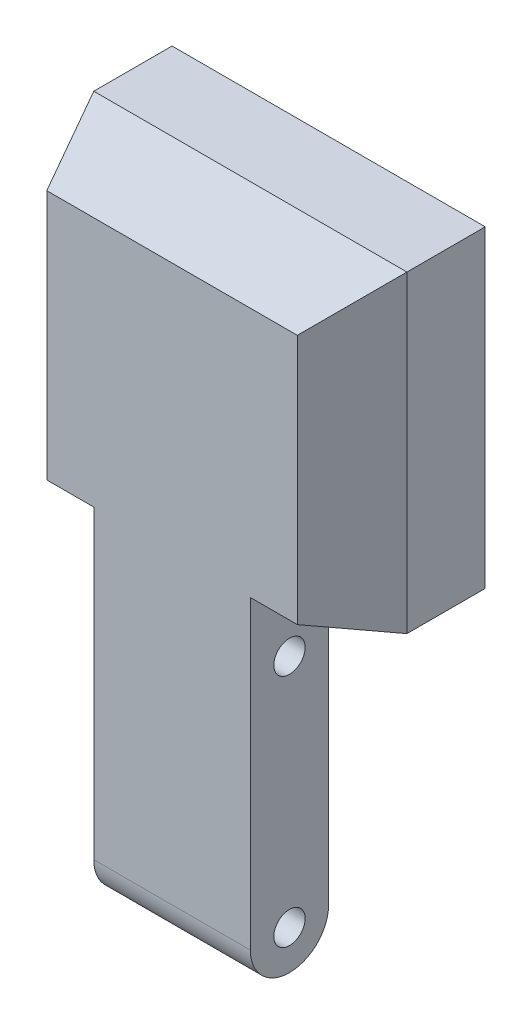
ISO-10303-21;
HEADER;
FILE_DESCRIPTION(('STEP AP214'),'2;1');
FILE_NAME('part.step','',(''),(''),'','','');
FILE_SCHEMA(('AUTOMOTIVE_DESIGN { 1 0 10303 214 1 1 1 1 }'));
ENDSEC;
DATA;
#1=APPLICATION_CONTEXT('core data for automotive mechanical design processes');
#2=APPLICATION_PROTOCOL_DEFINITION('international standard','automotive_design',2000,#1);
#3=PRODUCT_CONTEXT('',#1,'mechanical');
#4=PRODUCT('Part','Part','',(#3));
#5=PRODUCT_RELATED_PRODUCT_CATEGORY('part','',(#4));
#6=PRODUCT_DEFINITION_FORMATION('','',#4);
#7=PRODUCT_DEFINITION_CONTEXT('part definition',#1,'design');
#8=PRODUCT_DEFINITION('design','',#6,#7);
#9=PRODUCT_DEFINITION_SHAPE('','',#8);
#10=(LENGTH_UNIT() NAMED_UNIT(*) SI_UNIT(.MILLI.,.METRE.));
#11=(NAMED_UNIT(*) PLANE_ANGLE_UNIT() SI_UNIT($,.RADIAN.));
#12=(NAMED_UNIT(*) SI_UNIT($,.STERADIAN.) SOLID_ANGLE_UNIT());
#13=UNCERTAINTY_MEASURE_WITH_UNIT(LENGTH_MEASURE(1.E-05),#10,'distance_accuracy_value','');
#14=(GEOMETRIC_REPRESENTATION_CONTEXT(3) GLOBAL_UNCERTAINTY_ASSIGNED_CONTEXT((#13)) GLOBAL_UNIT_ASSIGNED_CONTEXT((#10,
#11,#12)) REPRESENTATION_CONTEXT('',''));
#15=CARTESIAN_POINT('',(0.,0.,0.));
#16=DIRECTION('',(0.,0.,1.));
#17=DIRECTION('',(1.,0.,0.));
#18=AXIS2_PLACEMENT_3D('',#15,#16,#17);
#19=CARTESIAN_POINT('',(-9.99999999999999,-4.44089209850063E-13,9.99999999999999));
#20=DIRECTION('',(-0.999999999999999,0.,0.));
#21=DIRECTION('',(0.,0.,1.));
#22=AXIS2_PLACEMENT_3D('',#19,#20,#21);
#23=PLANE('',#22);
#24=CARTESIAN_POINT('',(-9.99999999999998,-15.0000000000005,5.));
#25=DIRECTION('',(-0.999999999999999,0.,0.));
#26=DIRECTION('',(0.,0.,1.));
#27=AXIS2_PLACEMENT_3D('',#24,#25,#26);
#28=CIRCLE('',#27,2.);
#29=CARTESIAN_POINT('',(-9.99999999999998,-15.0000000000005,7.00000000000001));
#30=VERTEX_POINT('',#29);
#31=EDGE_CURVE('E163',#30,#30,#28,.T.);
#32=ORIENTED_EDGE('',*,*,#31,.F.);
#33=EDGE_LOOP('',(#32));
#34=FACE_BOUND('',#33,.T.);
#35=CARTESIAN_POINT('',(-9.99999999999997,14.9999999999996,4.99999999999995));
#36=DIRECTION('',(-0.999999999999999,0.,0.));
#37=DIRECTION('',(0.,0.,1.));
#38=AXIS2_PLACEMENT_3D('',#35,#36,#37);
#39=CIRCLE('',#38,2.);
#40=CARTESIAN_POINT('',(-9.99999999999997,14.9999999999996,6.99999999999995));
#41=VERTEX_POINT('',#40);
#42=EDGE_CURVE('E227',#41,#41,#39,.T.);
#43=ORIENTED_EDGE('',*,*,#42,.F.);
#44=EDGE_LOOP('',(#43));
#45=FACE_BOUND('',#44,.T.);
#46=CARTESIAN_POINT('',(-9.99999999999998,-15.0000000000005,5.));
#47=DIRECTION('',(-0.999999999999999,0.,0.));
#48=DIRECTION('',(0.,0.,1.));
#49=AXIS2_PLACEMENT_3D('',#46,#47,#48);
#50=CIRCLE('',#49,5.);
#51=CARTESIAN_POINT('',(-9.99999999999998,-15.,0.));
#52=VERTEX_POINT('',#51);
#53=CARTESIAN_POINT('',(-9.99999999999999,-15.0000000000005,9.99999999999999));
#54=VERTEX_POINT('',#53);
#55=EDGE_CURVE('E75',#52,#54,#50,.T.);
#56=ORIENTED_EDGE('',*,*,#55,.T.);
#57=DIRECTION('',(0.,1.,0.));
#58=VECTOR('',#57,1.);
#59=CARTESIAN_POINT('',(-9.99999999999999,-4.44089209850063E-13,9.99999999999999));
#60=LINE('',#59,#58);
#61=CARTESIAN_POINT('',(-9.99999999999998,23.9999999999996,9.99999999999995));
#62=VERTEX_POINT('',#61);
#63=EDGE_CURVE('E148',#54,#62,#60,.T.);
#64=ORIENTED_EDGE('',*,*,#63,.T.);
#65=DIRECTION('',(0.,-0.371390676354103,-0.928476690885261));
#66=VECTOR('',#65,1.);
#67=CARTESIAN_POINT('',(-9.99999999999998,20.,0.));
#68=LINE('',#67,#66);
#69=CARTESIAN_POINT('',(-9.99999999999998,20.,0.));
#70=VERTEX_POINT('',#69);
#71=EDGE_CURVE('E188',#62,#70,#68,.T.);
#72=ORIENTED_EDGE('',*,*,#71,.T.);
#73=DIRECTION('',(0.,1.,0.));
#74=VECTOR('',#73,1.);
#75=CARTESIAN_POINT('',(-9.99999999999999,0.,0.));
#76=LINE('',#75,#74);
#77=EDGE_CURVE('E161',#52,#70,#76,.T.);
#78=ORIENTED_EDGE('',*,*,#77,.F.);
#79=EDGE_LOOP('',(#56,#64,#72,#78));
#80=FACE_BOUND('',#79,.T.);
#81=ADVANCED_FACE('F60',(#34,#45,#80),#23,.T.);
#82=CARTESIAN_POINT('',(10.,0.,9.99999999999999));
#83=DIRECTION('',(-0.999999999999999,0.,0.));
#84=DIRECTION('',(0.,0.,1.));
#85=AXIS2_PLACEMENT_3D('',#82,#83,#84);
#86=PLANE('',#85);
#87=CARTESIAN_POINT('',(10.,-15.,4.99999999999999));
#88=DIRECTION('',(0.999999999999999,0.,0.));
#89=DIRECTION('',(0.,0.,-1.));
#90=AXIS2_PLACEMENT_3D('',#87,#88,#89);
#91=CIRCLE('',#90,2.);
#92=CARTESIAN_POINT('',(10.,-15.,2.99999999999999));
#93=VERTEX_POINT('',#92);
#94=EDGE_CURVE('E224',#93,#93,#91,.T.);
#95=ORIENTED_EDGE('',*,*,#94,.F.);
#96=EDGE_LOOP('',(#95));
#97=FACE_BOUND('',#96,.T.);
#98=CARTESIAN_POINT('',(9.99999999999999,15.,4.99999999999995));
#99=DIRECTION('',(0.999999999999999,0.,0.));
#100=DIRECTION('',(0.,0.,-1.));
#101=AXIS2_PLACEMENT_3D('',#98,#99,#100);
#102=CIRCLE('',#101,2.);
#103=CARTESIAN_POINT('',(9.99999999999999,15.,2.99999999999994));
#104=VERTEX_POINT('',#103);
#105=EDGE_CURVE('E223',#104,#104,#102,.T.);
#106=ORIENTED_EDGE('',*,*,#105,.F.);
#107=EDGE_LOOP('',(#106));
#108=FACE_BOUND('',#107,.T.);
#109=DIRECTION('',(0.,1.,0.));
#110=VECTOR('',#109,1.);
#111=CARTESIAN_POINT('',(10.,0.,9.99999999999999));
#112=LINE('',#111,#110);
#113=CARTESIAN_POINT('',(10.,-15.,9.99999999999999));
#114=VERTEX_POINT('',#113);
#115=CARTESIAN_POINT('',(9.99999999999998,24.,9.99999999999995));
#116=VERTEX_POINT('',#115);
#117=EDGE_CURVE('E145',#114,#116,#112,.T.);
#118=ORIENTED_EDGE('',*,*,#117,.F.);
#119=CARTESIAN_POINT('',(10.,-15.,4.99999999999999));
#120=DIRECTION('',(0.999999999999999,0.,0.));
#121=DIRECTION('',(0.,0.,-1.));
#122=AXIS2_PLACEMENT_3D('',#119,#120,#121);
#123=CIRCLE('',#122,5.);
#124=CARTESIAN_POINT('',(10.,-15.,0.));
#125=VERTEX_POINT('',#124);
#126=EDGE_CURVE('E135',#114,#125,#123,.T.);
#127=ORIENTED_EDGE('',*,*,#126,.T.);
#128=DIRECTION('',(0.,1.,0.));
#129=VECTOR('',#128,1.);
#130=CARTESIAN_POINT('',(10.,0.,0.));
#131=LINE('',#130,#129);
#132=CARTESIAN_POINT('',(9.99999999999998,20.,0.));
#133=VERTEX_POINT('',#132);
#134=EDGE_CURVE('E157',#125,#133,#131,.T.);
#135=ORIENTED_EDGE('',*,*,#134,.T.);
#136=DIRECTION('',(0.,0.371390676354103,0.928476690885261));
#137=VECTOR('',#136,1.);
#138=CARTESIAN_POINT('',(9.99999999999998,20.,0.));
#139=LINE('',#138,#137);
#140=EDGE_CURVE('E151',#133,#116,#139,.T.);
#141=ORIENTED_EDGE('',*,*,#140,.T.);
#142=EDGE_LOOP('',(#118,#127,#135,#141));
#143=FACE_BOUND('',#142,.T.);
#144=ADVANCED_FACE('F149',(#97,#108,#143),#86,.F.);
#145=CARTESIAN_POINT('',(0.,0.,10.));
#146=DIRECTION('',(0.,0.,1.));
#147=DIRECTION('',(0.999999999999999,0.,0.));
#148=AXIS2_PLACEMENT_3D('',#145,#146,#147);
#149=PLANE('',#148);
#150=ORIENTED_EDGE('',*,*,#63,.F.);
#151=DIRECTION('',(0.999999999999999,0.,0.));
#152=VECTOR('',#151,1.);
#153=CARTESIAN_POINT('',(-20.,-15.,10.));
#154=LINE('',#153,#152);
#155=EDGE_CURVE('E12',#54,#114,#154,.T.);
#156=ORIENTED_EDGE('',*,*,#155,.T.);
#157=ORIENTED_EDGE('',*,*,#117,.T.);
#158=DIRECTION('',(0.999999999999999,0.,0.));
#159=VECTOR('',#158,1.);
#160=CARTESIAN_POINT('',(9.99999999999998,24.,9.99999999999995));
#161=LINE('',#160,#159);
#162=CARTESIAN_POINT('',(16.,24.0000000000005,9.99999999999995));
#163=VERTEX_POINT('',#162);
#164=EDGE_CURVE('E203',#116,#163,#161,.T.);
#165=ORIENTED_EDGE('',*,*,#164,.T.);
#166=DIRECTION('',(0.,1.,0.));
#167=VECTOR('',#166,1.);
#168=CARTESIAN_POINT('',(16.,20.0000000000005,9.99999999999999));
#169=LINE('',#168,#167);
#170=CARTESIAN_POINT('',(16.,56.,9.99999999999996));
#171=VERTEX_POINT('',#170);
#172=EDGE_CURVE('E185',#163,#171,#169,.T.);
#173=ORIENTED_EDGE('',*,*,#172,.T.);
#174=DIRECTION('',(0.999999999999999,0.,0.));
#175=VECTOR('',#174,1.);
#176=CARTESIAN_POINT('',(-20.,55.9999999999999,9.99999999999999));
#177=LINE('',#176,#175);
#178=CARTESIAN_POINT('',(-16.,55.9999999999999,9.99999999999996));
#179=VERTEX_POINT('',#178);
#180=EDGE_CURVE('E178',#179,#171,#177,.T.);
#181=ORIENTED_EDGE('',*,*,#180,.F.);
#182=DIRECTION('',(0.,1.,0.));
#183=VECTOR('',#182,1.);
#184=CARTESIAN_POINT('',(-15.9999999999999,19.9999999999999,9.99999999999999));
#185=LINE('',#184,#183);
#186=CARTESIAN_POINT('',(-16.,23.9999999999999,9.99999999999995));
#187=VERTEX_POINT('',#186);
#188=EDGE_CURVE('E83',#187,#179,#185,.T.);
#189=ORIENTED_EDGE('',*,*,#188,.F.);
#190=DIRECTION('',(-0.999999999999999,0.,0.));
#191=VECTOR('',#190,1.);
#192=CARTESIAN_POINT('',(-9.99999999999998,23.9999999999996,9.99999999999995));
#193=LINE('',#192,#191);
#194=EDGE_CURVE('E196',#62,#187,#193,.T.);
#195=ORIENTED_EDGE('',*,*,#194,.F.);
#196=EDGE_LOOP('',(#150,#156,#157,#165,#173,#181,#189,#195));
#197=FACE_BOUND('',#196,.T.);
#198=ADVANCED_FACE('F143',(#197),#149,.T.);
#199=CARTESIAN_POINT('',(0.,0.,0.));
#200=DIRECTION('',(0.,0.,1.));
#201=DIRECTION('',(0.999999999999999,0.,0.));
#202=AXIS2_PLACEMENT_3D('',#199,#200,#201);
#203=PLANE('',#202);
#204=DIRECTION('',(0.999999999999999,0.,0.));
#205=VECTOR('',#204,1.);
#206=CARTESIAN_POINT('',(-19.9999999999999,-14.9999999999999,0.));
#207=LINE('',#206,#205);
#208=EDGE_CURVE('E68',#52,#125,#207,.T.);
#209=ORIENTED_EDGE('',*,*,#208,.F.);
#210=ORIENTED_EDGE('',*,*,#77,.T.);
#211=DIRECTION('',(0.999999999999999,0.,0.));
#212=VECTOR('',#211,1.);
#213=CARTESIAN_POINT('',(0.,20.,0.));
#214=LINE('',#213,#212);
#215=EDGE_CURVE('E166',#70,#133,#214,.T.);
#216=ORIENTED_EDGE('',*,*,#215,.T.);
#217=ORIENTED_EDGE('',*,*,#134,.F.);
#218=EDGE_LOOP('',(#209,#210,#216,#217));
#219=FACE_BOUND('',#218,.T.);
#220=ADVANCED_FACE('F281',(#219),#203,.F.);
#221=CARTESIAN_POINT('',(20.,4.44089209850063E-13,10.));
#222=DIRECTION('',(-0.999999999999999,0.,0.));
#223=DIRECTION('',(0.,0.,1.));
#224=AXIS2_PLACEMENT_3D('',#221,#222,#223);
#225=PLANE('',#224);
#226=DIRECTION('',(0.,0.,-1.));
#227=VECTOR('',#226,1.);
#228=CARTESIAN_POINT('',(20.,59.9999999999999,0.));
#229=LINE('',#228,#227);
#230=CARTESIAN_POINT('',(20.,59.9999999999999,0.));
#231=VERTEX_POINT('',#230);
#232=CARTESIAN_POINT('',(20.,59.9999999999999,-10.));
#233=VERTEX_POINT('',#232);
#234=EDGE_CURVE('E219',#231,#233,#229,.T.);
#235=ORIENTED_EDGE('',*,*,#234,.F.);
#236=DIRECTION('',(0.,1.,0.));
#237=VECTOR('',#236,1.);
#238=CARTESIAN_POINT('',(20.,19.9999999999999,0.));
#239=LINE('',#238,#237);
#240=CARTESIAN_POINT('',(20.,19.9999999999999,0.));
#241=VERTEX_POINT('',#240);
#242=EDGE_CURVE('E245',#241,#231,#239,.T.);
#243=ORIENTED_EDGE('',*,*,#242,.F.);
#244=DIRECTION('',(0.,0.,-1.));
#245=VECTOR('',#244,1.);
#246=CARTESIAN_POINT('',(20.,20.0000000000005,10.));
#247=LINE('',#246,#245);
#248=CARTESIAN_POINT('',(20.,19.9999999999996,-10.));
#249=VERTEX_POINT('',#248);
#250=EDGE_CURVE('E153',#241,#249,#247,.T.);
#251=ORIENTED_EDGE('',*,*,#250,.T.);
#252=DIRECTION('',(0.,1.,0.));
#253=VECTOR('',#252,1.);
#254=CARTESIAN_POINT('',(20.,19.9999999999996,-10.));
#255=LINE('',#254,#253);
#256=EDGE_CURVE('E205',#249,#233,#255,.T.);
#257=ORIENTED_EDGE('',*,*,#256,.T.);
#258=EDGE_LOOP('',(#235,#243,#251,#257));
#259=FACE_BOUND('',#258,.T.);
#260=ADVANCED_FACE('F62',(#259),#225,.F.);
#261=CARTESIAN_POINT('',(-20.,0.,10.));
#262=DIRECTION('',(-0.999999999999999,0.,0.));
#263=DIRECTION('',(0.,0.,1.));
#264=AXIS2_PLACEMENT_3D('',#261,#262,#263);
#265=PLANE('',#264);
#266=DIRECTION('',(0.,1.,0.));
#267=VECTOR('',#266,1.);
#268=CARTESIAN_POINT('',(-19.9999999999999,20.,0.));
#269=LINE('',#268,#267);
#270=CARTESIAN_POINT('',(-19.9999999999999,20.,0.));
#271=VERTEX_POINT('',#270);
#272=CARTESIAN_POINT('',(-19.9999999999999,60.0000000000004,0.));
#273=VERTEX_POINT('',#272);
#274=EDGE_CURVE('E249',#271,#273,#269,.T.);
#275=ORIENTED_EDGE('',*,*,#274,.T.);
#276=DIRECTION('',(0.,0.,1.));
#277=VECTOR('',#276,1.);
#278=CARTESIAN_POINT('',(-19.9999999999999,60.0000000000004,0.));
#279=LINE('',#278,#277);
#280=CARTESIAN_POINT('',(-20.,60.0000000000001,-9.99999999999999));
#281=VERTEX_POINT('',#280);
#282=EDGE_CURVE('E221',#281,#273,#279,.T.);
#283=ORIENTED_EDGE('',*,*,#282,.F.);
#284=DIRECTION('',(0.,-1.,0.));
#285=VECTOR('',#284,1.);
#286=CARTESIAN_POINT('',(-20.,20.,-10.));
#287=LINE('',#286,#285);
#288=CARTESIAN_POINT('',(-20.,20.,-10.));
#289=VERTEX_POINT('',#288);
#290=EDGE_CURVE('E213',#281,#289,#287,.T.);
#291=ORIENTED_EDGE('',*,*,#290,.T.);
#292=DIRECTION('',(0.,0.,-1.));
#293=VECTOR('',#292,1.);
#294=CARTESIAN_POINT('',(-19.9999999999999,19.9999999999999,10.));
#295=LINE('',#294,#293);
#296=EDGE_CURVE('E155',#271,#289,#295,.T.);
#297=ORIENTED_EDGE('',*,*,#296,.F.);
#298=EDGE_LOOP('',(#275,#283,#291,#297));
#299=FACE_BOUND('',#298,.T.);
#300=ADVANCED_FACE('F272',(#299),#265,.T.);
#301=CARTESIAN_POINT('',(0.,20.,9.99999999999999));
#302=DIRECTION('',(0.,1.,0.));
#303=DIRECTION('',(0.,0.,1.));
#304=AXIS2_PLACEMENT_3D('',#301,#302,#303);
#305=PLANE('',#304);
#306=ORIENTED_EDGE('',*,*,#215,.F.);
#307=DIRECTION('',(-0.999999999999999,0.,0.));
#308=VECTOR('',#307,1.);
#309=CARTESIAN_POINT('',(-9.99999999999998,20.,0.));
#310=LINE('',#309,#308);
#311=EDGE_CURVE('E197',#70,#271,#310,.T.);
#312=ORIENTED_EDGE('',*,*,#311,.T.);
#313=ORIENTED_EDGE('',*,*,#296,.T.);
#314=DIRECTION('',(0.999999999999999,0.,0.));
#315=VECTOR('',#314,1.);
#316=CARTESIAN_POINT('',(20.,19.9999999999996,-10.));
#317=LINE('',#316,#315);
#318=EDGE_CURVE('E216',#289,#249,#317,.T.);
#319=ORIENTED_EDGE('',*,*,#318,.T.);
#320=ORIENTED_EDGE('',*,*,#250,.F.);
#321=DIRECTION('',(0.999999999999999,0.,0.));
#322=VECTOR('',#321,1.);
#323=CARTESIAN_POINT('',(9.99999999999998,20.,0.));
#324=LINE('',#323,#322);
#325=EDGE_CURVE('E202',#133,#241,#324,.T.);
#326=ORIENTED_EDGE('',*,*,#325,.F.);
#327=EDGE_LOOP('',(#306,#312,#313,#319,#320,#326));
#328=FACE_BOUND('',#327,.T.);
#329=ADVANCED_FACE('F279',(#328),#305,.F.);
#330=CARTESIAN_POINT('',(-20.,15.0000000000003,4.99999999999998));
#331=DIRECTION('',(0.999999999999999,0.,0.));
#332=DIRECTION('',(0.,0.,-1.));
#333=AXIS2_PLACEMENT_3D('',#330,#331,#332);
#334=CYLINDRICAL_SURFACE('',#333,2.);
#335=ORIENTED_EDGE('',*,*,#42,.T.);
#336=EDGE_LOOP('',(#335));
#337=FACE_BOUND('',#336,.T.);
#338=ORIENTED_EDGE('',*,*,#105,.T.);
#339=EDGE_LOOP('',(#338));
#340=FACE_BOUND('',#339,.T.);
#341=ADVANCED_FACE('F293',(#337,#340),#334,.F.);
#342=CARTESIAN_POINT('',(-20.,-14.9999999999999,5.00000000000005));
#343=DIRECTION('',(0.999999999999999,0.,0.));
#344=DIRECTION('',(0.,0.,-1.));
#345=AXIS2_PLACEMENT_3D('',#342,#343,#344);
#346=CYLINDRICAL_SURFACE('',#345,2.);
#347=ORIENTED_EDGE('',*,*,#31,.T.);
#348=EDGE_LOOP('',(#347));
#349=FACE_BOUND('',#348,.T.);
#350=ORIENTED_EDGE('',*,*,#94,.T.);
#351=EDGE_LOOP('',(#350));
#352=FACE_BOUND('',#351,.T.);
#353=ADVANCED_FACE('F234',(#349,#352),#346,.F.);
#354=CARTESIAN_POINT('',(0.,60.0000000000001,0.));
#355=DIRECTION('',(0.,-1.,0.));
#356=DIRECTION('',(0.,0.,-1.));
#357=AXIS2_PLACEMENT_3D('',#354,#355,#356);
#358=PLANE('',#357);
#359=ORIENTED_EDGE('',*,*,#282,.T.);
#360=DIRECTION('',(0.999999999999999,0.,0.));
#361=VECTOR('',#360,1.);
#362=CARTESIAN_POINT('',(-19.9999999999999,60.0000000000004,0.));
#363=LINE('',#362,#361);
#364=EDGE_CURVE('E180',#273,#231,#363,.T.);
#365=ORIENTED_EDGE('',*,*,#364,.T.);
#366=ORIENTED_EDGE('',*,*,#234,.T.);
#367=DIRECTION('',(-0.999999999999999,0.,0.));
#368=VECTOR('',#367,1.);
#369=CARTESIAN_POINT('',(20.,59.9999999999999,-10.));
#370=LINE('',#369,#368);
#371=EDGE_CURVE('E210',#233,#281,#370,.T.);
#372=ORIENTED_EDGE('',*,*,#371,.T.);
#373=EDGE_LOOP('',(#359,#365,#366,#372));
#374=FACE_BOUND('',#373,.T.);
#375=ADVANCED_FACE('F265',(#374),#358,.F.);
#376=CARTESIAN_POINT('',(0.,0.,-10.));
#377=DIRECTION('',(0.,0.,1.));
#378=DIRECTION('',(0.999999999999999,0.,0.));
#379=AXIS2_PLACEMENT_3D('',#376,#377,#378);
#380=PLANE('',#379);
#381=ORIENTED_EDGE('',*,*,#256,.F.);
#382=ORIENTED_EDGE('',*,*,#318,.F.);
#383=ORIENTED_EDGE('',*,*,#290,.F.);
#384=ORIENTED_EDGE('',*,*,#371,.F.);
#385=EDGE_LOOP('',(#381,#382,#383,#384));
#386=FACE_BOUND('',#385,.T.);
#387=ADVANCED_FACE('F268',(#386),#380,.F.);
#388=CARTESIAN_POINT('',(9.99999999999998,20.,0.));
#389=DIRECTION('',(0.,0.928476690885261,-0.371390676354105));
#390=DIRECTION('',(0.,0.371390676354103,0.928476690885261));
#391=AXIS2_PLACEMENT_3D('',#388,#389,#390);
#392=PLANE('',#391);
#393=ORIENTED_EDGE('',*,*,#325,.T.);
#394=DIRECTION('',(-0.348155311911396,0.348155311911395,0.870388279778491));
#395=VECTOR('',#394,1.);
#396=CARTESIAN_POINT('',(18.7878787878788,21.2121212121212,3.03030303030298));
#397=LINE('',#396,#395);
#398=EDGE_CURVE('E191',#241,#163,#397,.T.);
#399=ORIENTED_EDGE('',*,*,#398,.T.);
#400=ORIENTED_EDGE('',*,*,#164,.F.);
#401=ORIENTED_EDGE('',*,*,#140,.F.);
#402=EDGE_LOOP('',(#393,#399,#400,#401));
#403=FACE_BOUND('',#402,.T.);
#404=ADVANCED_FACE('F254',(#403),#392,.F.);
#405=CARTESIAN_POINT('',(-9.99999999999998,20.,0.));
#406=DIRECTION('',(0.,0.928476690885261,-0.371390676354105));
#407=DIRECTION('',(0.,0.371390676354103,0.928476690885261));
#408=AXIS2_PLACEMENT_3D('',#405,#406,#407);
#409=PLANE('',#408);
#410=ORIENTED_EDGE('',*,*,#194,.T.);
#411=DIRECTION('',(-0.348155311911395,-0.348155311911395,-0.870388279778491));
#412=VECTOR('',#411,1.);
#413=CARTESIAN_POINT('',(-18.7878787878788,21.2121212121212,3.03030303030299));
#414=LINE('',#413,#412);
#415=EDGE_CURVE('E186',#187,#271,#414,.T.);
#416=ORIENTED_EDGE('',*,*,#415,.T.);
#417=ORIENTED_EDGE('',*,*,#311,.F.);
#418=ORIENTED_EDGE('',*,*,#71,.F.);
#419=EDGE_LOOP('',(#410,#416,#417,#418));
#420=FACE_BOUND('',#419,.T.);
#421=ADVANCED_FACE('F276',(#420),#409,.F.);
#422=CARTESIAN_POINT('',(-20.,55.9999999999999,9.99999999999999));
#423=DIRECTION('',(0.,-0.928476690885261,-0.371390676354103));
#424=DIRECTION('',(0.,0.371390676354105,-0.928476690885261));
#425=AXIS2_PLACEMENT_3D('',#422,#423,#424);
#426=PLANE('',#425);
#427=ORIENTED_EDGE('',*,*,#364,.F.);
#428=DIRECTION('',(0.348155311911395,-0.348155311911396,0.870388279778491));
#429=VECTOR('',#428,1.);
#430=CARTESIAN_POINT('',(-16.4848484848485,56.4848484848485,8.78787878787873));
#431=LINE('',#430,#429);
#432=EDGE_CURVE('E172',#273,#179,#431,.T.);
#433=ORIENTED_EDGE('',*,*,#432,.T.);
#434=ORIENTED_EDGE('',*,*,#180,.T.);
#435=DIRECTION('',(0.348155311911396,0.348155311911396,-0.870388279778491));
#436=VECTOR('',#435,1.);
#437=CARTESIAN_POINT('',(11.6363636363636,51.6363636363637,20.9090909090909));
#438=LINE('',#437,#436);
#439=EDGE_CURVE('E169',#171,#231,#438,.T.);
#440=ORIENTED_EDGE('',*,*,#439,.T.);
#441=EDGE_LOOP('',(#427,#433,#434,#440));
#442=FACE_BOUND('',#441,.T.);
#443=ADVANCED_FACE('F177',(#442),#426,.F.);
#444=CARTESIAN_POINT('',(20.,19.9999999999999,0.));
#445=DIRECTION('',(-0.928476690885258,0.,-0.371390676354104));
#446=DIRECTION('',(-0.371390676354103,0.,0.928476690885261));
#447=AXIS2_PLACEMENT_3D('',#444,#445,#446);
#448=PLANE('',#447);
#449=ORIENTED_EDGE('',*,*,#242,.T.);
#450=ORIENTED_EDGE('',*,*,#439,.F.);
#451=ORIENTED_EDGE('',*,*,#172,.F.);
#452=ORIENTED_EDGE('',*,*,#398,.F.);
#453=EDGE_LOOP('',(#449,#450,#451,#452));
#454=FACE_BOUND('',#453,.T.);
#455=ADVANCED_FACE('F259',(#454),#448,.F.);
#456=CARTESIAN_POINT('',(-19.9999999999999,20.,0.));
#457=DIRECTION('',(0.928476690885258,0.,-0.371390676354104));
#458=DIRECTION('',(-0.371390676354103,0.,-0.928476690885261));
#459=AXIS2_PLACEMENT_3D('',#456,#457,#458);
#460=PLANE('',#459);
#461=ORIENTED_EDGE('',*,*,#188,.T.);
#462=ORIENTED_EDGE('',*,*,#432,.F.);
#463=ORIENTED_EDGE('',*,*,#274,.F.);
#464=ORIENTED_EDGE('',*,*,#415,.F.);
#465=EDGE_LOOP('',(#461,#462,#463,#464));
#466=FACE_BOUND('',#465,.T.);
#467=ADVANCED_FACE('F273',(#466),#460,.F.);
#468=CARTESIAN_POINT('',(-20.,-14.9999999999999,5.00000000000005));
#469=DIRECTION('',(0.999999999999999,0.,0.));
#470=DIRECTION('',(0.,0.,-1.));
#471=AXIS2_PLACEMENT_3D('',#468,#469,#470);
#472=CYLINDRICAL_SURFACE('',#471,5.);
#473=ORIENTED_EDGE('',*,*,#208,.T.);
#474=ORIENTED_EDGE('',*,*,#126,.F.);
#475=ORIENTED_EDGE('',*,*,#155,.F.);
#476=ORIENTED_EDGE('',*,*,#55,.F.);
#477=EDGE_LOOP('',(#473,#474,#475,#476));
#478=FACE_BOUND('',#477,.T.);
#479=ADVANCED_FACE('F136',(#478),#472,.T.);
#480=CLOSED_SHELL('',(#81,#144,#198,#220,#260,#300,#329,#341,#353,#375,#387,#404,#421,#443,#455,
#467,#479));
#481=MANIFOLD_SOLID_BREP('B2',#480);
#482=ADVANCED_BREP_SHAPE_REPRESENTATION('',(#18,#481),#14);
#483=SHAPE_DEFINITION_REPRESENTATION(#9,#482);
ENDSEC;
END-ISO-10303-21;
